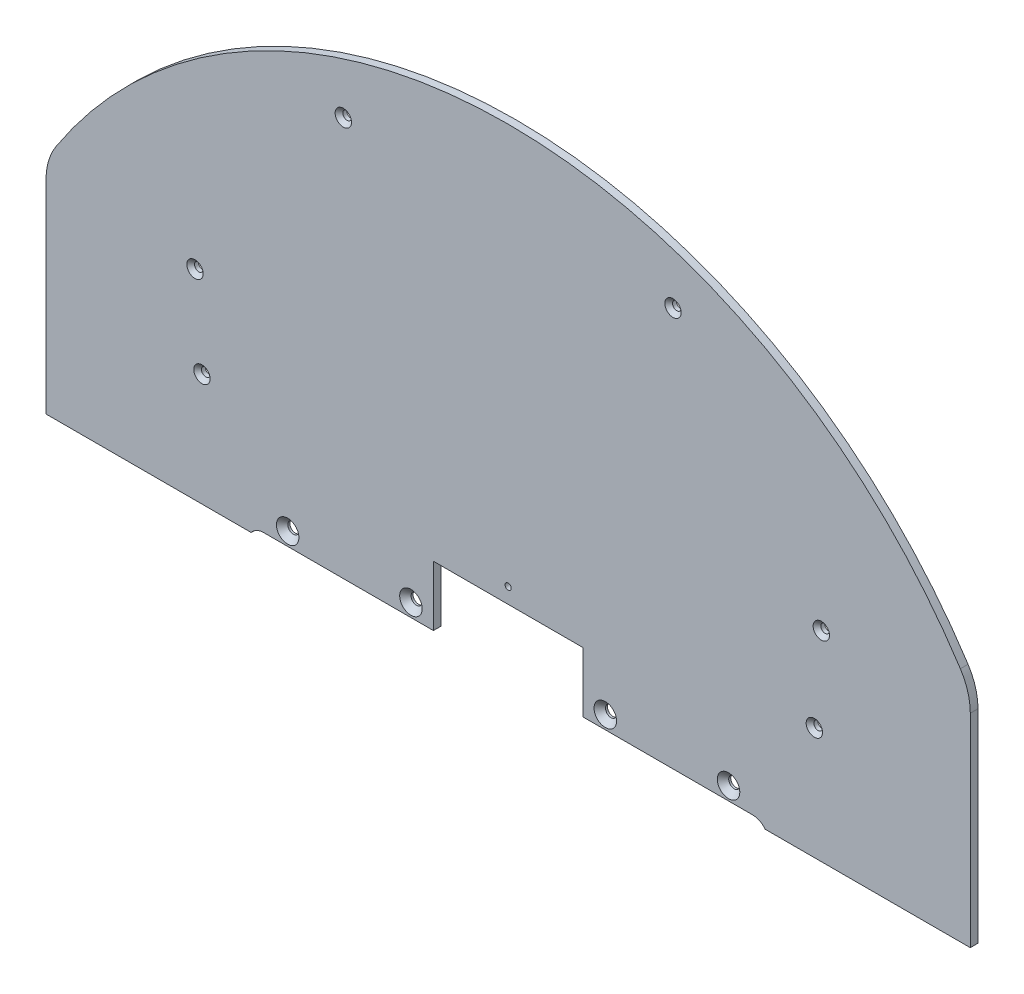
ISO-10303-21;
HEADER;
FILE_DESCRIPTION(('STEP AP214'),'2;1');
FILE_NAME('part.step','',(''),(''),'','','');
FILE_SCHEMA(('AUTOMOTIVE_DESIGN { 1 0 10303 214 1 1 1 1 }'));
ENDSEC;
DATA;
#1=APPLICATION_CONTEXT('core data for automotive mechanical design processes');
#2=APPLICATION_PROTOCOL_DEFINITION('international standard','automotive_design',2000,#1);
#3=PRODUCT_CONTEXT('',#1,'mechanical');
#4=PRODUCT('Part','Part','',(#3));
#5=PRODUCT_RELATED_PRODUCT_CATEGORY('part','',(#4));
#6=PRODUCT_DEFINITION_FORMATION('','',#4);
#7=PRODUCT_DEFINITION_CONTEXT('part definition',#1,'design');
#8=PRODUCT_DEFINITION('design','',#6,#7);
#9=PRODUCT_DEFINITION_SHAPE('','',#8);
#10=(LENGTH_UNIT() NAMED_UNIT(*) SI_UNIT(.MILLI.,.METRE.));
#11=(NAMED_UNIT(*) PLANE_ANGLE_UNIT() SI_UNIT($,.RADIAN.));
#12=(NAMED_UNIT(*) SI_UNIT($,.STERADIAN.) SOLID_ANGLE_UNIT());
#13=UNCERTAINTY_MEASURE_WITH_UNIT(LENGTH_MEASURE(1.E-05),#10,'distance_accuracy_value','');
#14=(GEOMETRIC_REPRESENTATION_CONTEXT(3) GLOBAL_UNCERTAINTY_ASSIGNED_CONTEXT((#13)) GLOBAL_UNIT_ASSIGNED_CONTEXT((#10,
#11,#12)) REPRESENTATION_CONTEXT('',''));
#15=CARTESIAN_POINT('',(0.,0.,0.));
#16=DIRECTION('',(0.,0.,1.));
#17=DIRECTION('',(1.,0.,0.));
#18=AXIS2_PLACEMENT_3D('',#15,#16,#17);
#19=CARTESIAN_POINT('',(-124.0409,61.2393999999982,145.6309));
#20=DIRECTION('',(0.,0.,-1.));
#21=DIRECTION('',(0.,-1.,0.));
#22=AXIS2_PLACEMENT_3D('',#19,#20,#21);
#23=CYLINDRICAL_SURFACE('',#22,1.778);
#24=CARTESIAN_POINT('',(-124.0409,61.2393999999982,144.0434));
#25=DIRECTION('',(0.,0.,-1.));
#26=DIRECTION('',(0.,-1.,0.));
#27=AXIS2_PLACEMENT_3D('',#24,#25,#26);
#28=CIRCLE('',#27,1.778);
#29=CARTESIAN_POINT('',(-124.0409,59.4613999999982,144.0434));
#30=VERTEX_POINT('',#29);
#31=EDGE_CURVE('E366',#30,#30,#28,.F.);
#32=ORIENTED_EDGE('',*,*,#31,.F.);
#33=EDGE_LOOP('',(#32));
#34=FACE_BOUND('',#33,.T.);
#35=CARTESIAN_POINT('',(-124.0409,61.2393999999982,145.6309));
#36=DIRECTION('',(0.,0.,1.));
#37=DIRECTION('',(0.,1.,0.));
#38=AXIS2_PLACEMENT_3D('',#35,#36,#37);
#39=CIRCLE('',#38,1.778);
#40=CARTESIAN_POINT('',(-124.0409,63.0173999999982,145.6309));
#41=VERTEX_POINT('',#40);
#42=EDGE_CURVE('E271',#41,#41,#39,.T.);
#43=ORIENTED_EDGE('',*,*,#42,.T.);
#44=EDGE_LOOP('',(#43));
#45=FACE_BOUND('',#44,.T.);
#46=ADVANCED_FACE('F36',(#34,#45),#23,.F.);
#47=CARTESIAN_POINT('',(134.1247,61.2393999999981,145.6309));
#48=DIRECTION('',(0.,0.,-1.));
#49=DIRECTION('',(0.,-1.,0.));
#50=AXIS2_PLACEMENT_3D('',#47,#48,#49);
#51=CYLINDRICAL_SURFACE('',#50,1.778);
#52=CARTESIAN_POINT('',(134.1247,61.2393999999981,144.0434));
#53=DIRECTION('',(0.,0.,-1.));
#54=DIRECTION('',(0.,-1.,0.));
#55=AXIS2_PLACEMENT_3D('',#52,#53,#54);
#56=CIRCLE('',#55,1.778);
#57=CARTESIAN_POINT('',(134.1247,59.4613999999981,144.0434));
#58=VERTEX_POINT('',#57);
#59=EDGE_CURVE('E363',#58,#58,#56,.F.);
#60=ORIENTED_EDGE('',*,*,#59,.F.);
#61=EDGE_LOOP('',(#60));
#62=FACE_BOUND('',#61,.T.);
#63=CARTESIAN_POINT('',(134.1247,61.2393999999981,145.6309));
#64=DIRECTION('',(0.,0.,1.));
#65=DIRECTION('',(0.,1.,0.));
#66=AXIS2_PLACEMENT_3D('',#63,#64,#65);
#67=CIRCLE('',#66,1.778);
#68=CARTESIAN_POINT('',(134.1247,63.0173999999981,145.6309));
#69=VERTEX_POINT('',#68);
#70=EDGE_CURVE('E274',#69,#69,#67,.T.);
#71=ORIENTED_EDGE('',*,*,#70,.T.);
#72=EDGE_LOOP('',(#71));
#73=FACE_BOUND('',#72,.T.);
#74=ADVANCED_FACE('F783',(#62,#73),#51,.F.);
#75=CARTESIAN_POINT('',(-62.9031000000003,145.859499999998,145.6309));
#76=DIRECTION('',(0.,0.,-1.));
#77=DIRECTION('',(0.,-1.,0.));
#78=AXIS2_PLACEMENT_3D('',#75,#76,#77);
#79=CYLINDRICAL_SURFACE('',#78,1.77800000000002);
#80=CARTESIAN_POINT('',(-62.9031000000003,145.859499999998,144.0434));
#81=DIRECTION('',(0.,0.,-1.));
#82=DIRECTION('',(0.,-1.,0.));
#83=AXIS2_PLACEMENT_3D('',#80,#81,#82);
#84=CIRCLE('',#83,1.77800000000002);
#85=CARTESIAN_POINT('',(-62.9031000000003,144.081499999998,144.0434));
#86=VERTEX_POINT('',#85);
#87=EDGE_CURVE('E360',#86,#86,#84,.F.);
#88=ORIENTED_EDGE('',*,*,#87,.F.);
#89=EDGE_LOOP('',(#88));
#90=FACE_BOUND('',#89,.T.);
#91=CARTESIAN_POINT('',(-62.9031000000003,145.859499999998,145.6309));
#92=DIRECTION('',(0.,0.,1.));
#93=DIRECTION('',(0.,1.,0.));
#94=AXIS2_PLACEMENT_3D('',#91,#92,#93);
#95=CIRCLE('',#94,1.77800000000002);
#96=CARTESIAN_POINT('',(-62.9031000000003,147.637499999998,145.6309));
#97=VERTEX_POINT('',#96);
#98=EDGE_CURVE('E277',#97,#97,#95,.T.);
#99=ORIENTED_EDGE('',*,*,#98,.T.);
#100=EDGE_LOOP('',(#99));
#101=FACE_BOUND('',#100,.T.);
#102=ADVANCED_FACE('F772',(#90,#101),#79,.F.);
#103=CARTESIAN_POINT('',(72.9868999999998,145.859499999998,145.6309));
#104=DIRECTION('',(0.,0.,-1.));
#105=DIRECTION('',(0.,-1.,0.));
#106=AXIS2_PLACEMENT_3D('',#103,#104,#105);
#107=CYLINDRICAL_SURFACE('',#106,1.778);
#108=CARTESIAN_POINT('',(72.9868999999998,145.859499999998,144.0434));
#109=DIRECTION('',(0.,0.,-1.));
#110=DIRECTION('',(0.,-1.,0.));
#111=AXIS2_PLACEMENT_3D('',#108,#109,#110);
#112=CIRCLE('',#111,1.778);
#113=CARTESIAN_POINT('',(72.9868999999998,144.081499999998,144.0434));
#114=VERTEX_POINT('',#113);
#115=EDGE_CURVE('E357',#114,#114,#112,.F.);
#116=ORIENTED_EDGE('',*,*,#115,.F.);
#117=EDGE_LOOP('',(#116));
#118=FACE_BOUND('',#117,.T.);
#119=CARTESIAN_POINT('',(72.9868999999998,145.859499999998,145.6309));
#120=DIRECTION('',(0.,0.,1.));
#121=DIRECTION('',(0.,1.,0.));
#122=AXIS2_PLACEMENT_3D('',#119,#120,#121);
#123=CIRCLE('',#122,1.778);
#124=CARTESIAN_POINT('',(72.9868999999998,147.637499999998,145.6309));
#125=VERTEX_POINT('',#124);
#126=EDGE_CURVE('E280',#125,#125,#123,.T.);
#127=ORIENTED_EDGE('',*,*,#126,.T.);
#128=EDGE_LOOP('',(#127));
#129=FACE_BOUND('',#128,.T.);
#130=ADVANCED_FACE('F761',(#118,#129),#107,.F.);
#131=CARTESIAN_POINT('',(-121.1707,25.1459999999989,145.6309));
#132=DIRECTION('',(0.,0.,-1.));
#133=DIRECTION('',(0.,-1.,0.));
#134=AXIS2_PLACEMENT_3D('',#131,#132,#133);
#135=CYLINDRICAL_SURFACE('',#134,1.77799999999999);
#136=CARTESIAN_POINT('',(-121.1707,25.1459999999989,144.0434));
#137=DIRECTION('',(0.,0.,-1.));
#138=DIRECTION('',(0.,-1.,0.));
#139=AXIS2_PLACEMENT_3D('',#136,#137,#138);
#140=CIRCLE('',#139,1.77799999999999);
#141=CARTESIAN_POINT('',(-121.1707,23.367999999999,144.0434));
#142=VERTEX_POINT('',#141);
#143=EDGE_CURVE('E354',#142,#142,#140,.F.);
#144=ORIENTED_EDGE('',*,*,#143,.F.);
#145=EDGE_LOOP('',(#144));
#146=FACE_BOUND('',#145,.T.);
#147=CARTESIAN_POINT('',(-121.1707,25.1459999999989,145.6309));
#148=DIRECTION('',(0.,0.,1.));
#149=DIRECTION('',(0.,1.,0.));
#150=AXIS2_PLACEMENT_3D('',#147,#148,#149);
#151=CIRCLE('',#150,1.77799999999999);
#152=CARTESIAN_POINT('',(-121.1707,26.9239999999989,145.6309));
#153=VERTEX_POINT('',#152);
#154=EDGE_CURVE('E283',#153,#153,#151,.T.);
#155=ORIENTED_EDGE('',*,*,#154,.T.);
#156=EDGE_LOOP('',(#155));
#157=FACE_BOUND('',#156,.T.);
#158=ADVANCED_FACE('F750',(#146,#157),#135,.F.);
#159=CARTESIAN_POINT('',(131.2545,25.1459999999989,145.6309));
#160=DIRECTION('',(0.,0.,-1.));
#161=DIRECTION('',(0.,-1.,0.));
#162=AXIS2_PLACEMENT_3D('',#159,#160,#161);
#163=CYLINDRICAL_SURFACE('',#162,1.778);
#164=CARTESIAN_POINT('',(131.2545,25.1459999999989,144.0434));
#165=DIRECTION('',(0.,0.,-1.));
#166=DIRECTION('',(0.,-1.,0.));
#167=AXIS2_PLACEMENT_3D('',#164,#165,#166);
#168=CIRCLE('',#167,1.778);
#169=CARTESIAN_POINT('',(131.2545,23.3679999999989,144.0434));
#170=VERTEX_POINT('',#169);
#171=EDGE_CURVE('E351',#170,#170,#168,.F.);
#172=ORIENTED_EDGE('',*,*,#171,.F.);
#173=EDGE_LOOP('',(#172));
#174=FACE_BOUND('',#173,.T.);
#175=CARTESIAN_POINT('',(131.2545,25.1459999999989,145.6309));
#176=DIRECTION('',(0.,0.,1.));
#177=DIRECTION('',(0.,1.,0.));
#178=AXIS2_PLACEMENT_3D('',#175,#176,#177);
#179=CIRCLE('',#178,1.778);
#180=CARTESIAN_POINT('',(131.2545,26.9239999999989,145.6309));
#181=VERTEX_POINT('',#180);
#182=EDGE_CURVE('E257',#181,#181,#179,.T.);
#183=ORIENTED_EDGE('',*,*,#182,.T.);
#184=EDGE_LOOP('',(#183));
#185=FACE_BOUND('',#184,.T.);
#186=ADVANCED_FACE('F739',(#174,#185),#163,.F.);
#187=CARTESIAN_POINT('',(-85.8393000000004,-13.2080000000011,144.8689));
#188=DIRECTION('',(0.,0.,-1.));
#189=DIRECTION('',(0.,-1.,0.));
#190=AXIS2_PLACEMENT_3D('',#187,#188,#189);
#191=CYLINDRICAL_SURFACE('',#190,2.28600000000002);
#192=CARTESIAN_POINT('',(-85.8393000000004,-13.2080000000011,144.0434));
#193=DIRECTION('',(0.,0.,-1.));
#194=DIRECTION('',(0.,-1.,0.));
#195=AXIS2_PLACEMENT_3D('',#192,#193,#194);
#196=CIRCLE('',#195,2.28600000000002);
#197=CARTESIAN_POINT('',(-85.8393000000004,-15.4940000000011,144.0434));
#198=VERTEX_POINT('',#197);
#199=EDGE_CURVE('E348',#198,#198,#196,.F.);
#200=ORIENTED_EDGE('',*,*,#199,.F.);
#201=EDGE_LOOP('',(#200));
#202=FACE_BOUND('',#201,.T.);
#203=CARTESIAN_POINT('',(-85.8393000000004,-13.208000000001,144.8689));
#204=DIRECTION('',(0.,0.,1.));
#205=DIRECTION('',(0.,1.,0.));
#206=AXIS2_PLACEMENT_3D('',#203,#204,#205);
#207=CIRCLE('',#206,2.28599999999999);
#208=CARTESIAN_POINT('',(-85.8393000000004,-10.922000000001,144.8689));
#209=VERTEX_POINT('',#208);
#210=EDGE_CURVE('E268',#209,#209,#207,.T.);
#211=ORIENTED_EDGE('',*,*,#210,.T.);
#212=EDGE_LOOP('',(#211));
#213=FACE_BOUND('',#212,.T.);
#214=ADVANCED_FACE('F728',(#202,#213),#191,.F.);
#215=CARTESIAN_POINT('',(-35.0393000000003,-13.208000000001,144.8689));
#216=DIRECTION('',(0.,0.,-1.));
#217=DIRECTION('',(0.,-1.,0.));
#218=AXIS2_PLACEMENT_3D('',#215,#216,#217);
#219=CYLINDRICAL_SURFACE('',#218,2.28600000000001);
#220=CARTESIAN_POINT('',(-35.0393000000003,-13.208000000001,144.0434));
#221=DIRECTION('',(0.,0.,-1.));
#222=DIRECTION('',(0.,-1.,0.));
#223=AXIS2_PLACEMENT_3D('',#220,#221,#222);
#224=CIRCLE('',#223,2.28600000000001);
#225=CARTESIAN_POINT('',(-35.0393000000003,-15.494000000001,144.0434));
#226=VERTEX_POINT('',#225);
#227=EDGE_CURVE('E345',#226,#226,#224,.F.);
#228=ORIENTED_EDGE('',*,*,#227,.F.);
#229=EDGE_LOOP('',(#228));
#230=FACE_BOUND('',#229,.T.);
#231=CARTESIAN_POINT('',(-35.0393000000003,-13.208000000001,144.8689));
#232=DIRECTION('',(0.,0.,1.));
#233=DIRECTION('',(0.,1.,0.));
#234=AXIS2_PLACEMENT_3D('',#231,#232,#233);
#235=CIRCLE('',#234,2.28600000000001);
#236=CARTESIAN_POINT('',(-35.0393000000003,-10.922000000001,144.8689));
#237=VERTEX_POINT('',#236);
#238=EDGE_CURVE('E265',#237,#237,#235,.T.);
#239=ORIENTED_EDGE('',*,*,#238,.T.);
#240=EDGE_LOOP('',(#239));
#241=FACE_BOUND('',#240,.T.);
#242=ADVANCED_FACE('F717',(#230,#241),#219,.F.);
#243=CARTESIAN_POINT('',(45.0976999999997,-13.2080000000011,144.8689));
#244=DIRECTION('',(0.,0.,-1.));
#245=DIRECTION('',(0.,-1.,0.));
#246=AXIS2_PLACEMENT_3D('',#243,#244,#245);
#247=CYLINDRICAL_SURFACE('',#246,2.286);
#248=CARTESIAN_POINT('',(45.0976999999997,-13.2080000000011,144.0434));
#249=DIRECTION('',(0.,0.,-1.));
#250=DIRECTION('',(0.,-1.,0.));
#251=AXIS2_PLACEMENT_3D('',#248,#249,#250);
#252=CIRCLE('',#251,2.286);
#253=CARTESIAN_POINT('',(45.0976999999997,-15.4940000000011,144.0434));
#254=VERTEX_POINT('',#253);
#255=EDGE_CURVE('E342',#254,#254,#252,.F.);
#256=ORIENTED_EDGE('',*,*,#255,.F.);
#257=EDGE_LOOP('',(#256));
#258=FACE_BOUND('',#257,.T.);
#259=CARTESIAN_POINT('',(45.0976999999997,-13.2080000000013,144.8689));
#260=DIRECTION('',(0.,0.,1.));
#261=DIRECTION('',(0.,1.,0.));
#262=AXIS2_PLACEMENT_3D('',#259,#260,#261);
#263=CIRCLE('',#262,2.28600000000012);
#264=CARTESIAN_POINT('',(45.0976999999997,-10.9220000000012,144.8689));
#265=VERTEX_POINT('',#264);
#266=EDGE_CURVE('E262',#265,#265,#263,.T.);
#267=ORIENTED_EDGE('',*,*,#266,.T.);
#268=EDGE_LOOP('',(#267));
#269=FACE_BOUND('',#268,.T.);
#270=ADVANCED_FACE('F706',(#258,#269),#247,.F.);
#271=CARTESIAN_POINT('',(95.8976999999997,-13.2080000000011,144.8689));
#272=DIRECTION('',(0.,0.,-1.));
#273=DIRECTION('',(0.,-1.,0.));
#274=AXIS2_PLACEMENT_3D('',#271,#272,#273);
#275=CYLINDRICAL_SURFACE('',#274,2.28600000000001);
#276=CARTESIAN_POINT('',(95.8976999999997,-13.2080000000011,144.0434));
#277=DIRECTION('',(0.,0.,-1.));
#278=DIRECTION('',(0.,-1.,0.));
#279=AXIS2_PLACEMENT_3D('',#276,#277,#278);
#280=CIRCLE('',#279,2.28600000000001);
#281=CARTESIAN_POINT('',(95.8976999999997,-15.4940000000011,144.0434));
#282=VERTEX_POINT('',#281);
#283=EDGE_CURVE('E339',#282,#282,#280,.F.);
#284=ORIENTED_EDGE('',*,*,#283,.F.);
#285=EDGE_LOOP('',(#284));
#286=FACE_BOUND('',#285,.T.);
#287=CARTESIAN_POINT('',(95.8976999999997,-13.2080000000014,144.8689));
#288=DIRECTION('',(0.,0.,1.));
#289=DIRECTION('',(0.,1.,0.));
#290=AXIS2_PLACEMENT_3D('',#287,#288,#289);
#291=CIRCLE('',#290,2.28600000000014);
#292=CARTESIAN_POINT('',(95.8976999999997,-10.9220000000012,144.8689));
#293=VERTEX_POINT('',#292);
#294=EDGE_CURVE('E215',#293,#293,#291,.T.);
#295=ORIENTED_EDGE('',*,*,#294,.T.);
#296=EDGE_LOOP('',(#295));
#297=FACE_BOUND('',#296,.T.);
#298=ADVANCED_FACE('F696',(#286,#297),#275,.F.);
#299=CARTESIAN_POINT('',(105.8799,-18.6690000000011,144.0434));
#300=DIRECTION('',(0.,-1.,0.));
#301=DIRECTION('',(0.,0.,1.));
#302=AXIS2_PLACEMENT_3D('',#299,#300,#301);
#303=PLANE('',#302);
#304=DIRECTION('',(0.,0.,1.));
#305=VECTOR('',#304,1.);
#306=CARTESIAN_POINT('',(35.8266999999997,-18.669000000001,145.6309));
#307=LINE('',#306,#305);
#308=CARTESIAN_POINT('',(35.8266999999992,-18.6690000000012,144.0434));
#309=VERTEX_POINT('',#308);
#310=CARTESIAN_POINT('',(35.8266999999992,-18.6690000000012,147.2184));
#311=VERTEX_POINT('',#310);
#312=EDGE_CURVE('E228',#309,#311,#307,.T.);
#313=ORIENTED_EDGE('',*,*,#312,.F.);
#314=DIRECTION('',(-1.,0.,0.));
#315=VECTOR('',#314,1.);
#316=CARTESIAN_POINT('',(5.04189999999904,-18.6690000000013,144.0434));
#317=LINE('',#316,#315);
#318=CARTESIAN_POINT('',(105.8799,-18.6690000000012,144.0434));
#319=VERTEX_POINT('',#318);
#320=EDGE_CURVE('E188',#319,#309,#317,.T.);
#321=ORIENTED_EDGE('',*,*,#320,.F.);
#322=DIRECTION('',(0.,0.,-1.));
#323=VECTOR('',#322,1.);
#324=CARTESIAN_POINT('',(105.8799,-18.669000000001,145.6309));
#325=LINE('',#324,#323);
#326=CARTESIAN_POINT('',(105.8799,-18.6690000000011,147.2184));
#327=VERTEX_POINT('',#326);
#328=EDGE_CURVE('E225',#327,#319,#325,.T.);
#329=ORIENTED_EDGE('',*,*,#328,.F.);
#330=DIRECTION('',(1.,0.,0.));
#331=VECTOR('',#330,1.);
#332=CARTESIAN_POINT('',(5.04189999999903,-18.6690000000012,147.2184));
#333=LINE('',#332,#331);
#334=EDGE_CURVE('E213',#311,#327,#333,.T.);
#335=ORIENTED_EDGE('',*,*,#334,.F.);
#336=EDGE_LOOP('',(#313,#321,#329,#335));
#337=FACE_BOUND('',#336,.T.);
#338=ADVANCED_FACE('F403',(#337),#303,.T.);
#339=CARTESIAN_POINT('',(105.8799,-25.0190000000013,147.2184));
#340=DIRECTION('',(0.,0.,-1.));
#341=DIRECTION('',(0.,-1.,0.));
#342=AXIS2_PLACEMENT_3D('',#339,#340,#341);
#343=CYLINDRICAL_SURFACE('',#342,6.35000000000011);
#344=CARTESIAN_POINT('',(105.8799,-25.0190000000013,147.2184));
#345=DIRECTION('',(0.,0.,-1.));
#346=DIRECTION('',(0.,-1.,0.));
#347=AXIS2_PLACEMENT_3D('',#344,#345,#346);
#348=CIRCLE('',#347,6.35000000000011);
#349=CARTESIAN_POINT('',(110.9599,-21.2090000000012,147.2184));
#350=VERTEX_POINT('',#349);
#351=EDGE_CURVE('E334',#327,#350,#348,.T.);
#352=ORIENTED_EDGE('',*,*,#351,.F.);
#353=ORIENTED_EDGE('',*,*,#328,.T.);
#354=CARTESIAN_POINT('',(105.8799,-25.0190000000013,144.0434));
#355=DIRECTION('',(0.,0.,-1.));
#356=DIRECTION('',(0.,-1.,0.));
#357=AXIS2_PLACEMENT_3D('',#354,#355,#356);
#358=CIRCLE('',#357,6.35000000000011);
#359=CARTESIAN_POINT('',(110.9599,-21.2090000000012,144.0434));
#360=VERTEX_POINT('',#359);
#361=EDGE_CURVE('E174',#360,#319,#358,.F.);
#362=ORIENTED_EDGE('',*,*,#361,.F.);
#363=DIRECTION('',(0.,0.,-1.));
#364=VECTOR('',#363,1.);
#365=CARTESIAN_POINT('',(110.9599,-21.2090000000011,145.6309));
#366=LINE('',#365,#364);
#367=EDGE_CURVE('E221',#350,#360,#366,.T.);
#368=ORIENTED_EDGE('',*,*,#367,.F.);
#369=EDGE_LOOP('',(#352,#353,#362,#368));
#370=FACE_BOUND('',#369,.T.);
#371=ADVANCED_FACE('F400',(#370),#343,.F.);
#372=CARTESIAN_POINT('',(195.541899999999,-21.2090000000011,144.0434));
#373=DIRECTION('',(0.,-1.,0.));
#374=DIRECTION('',(0.,0.,1.));
#375=AXIS2_PLACEMENT_3D('',#372,#373,#374);
#376=PLANE('',#375);
#377=DIRECTION('',(1.,0.,0.));
#378=VECTOR('',#377,1.);
#379=CARTESIAN_POINT('',(5.04189999999904,-21.2090000000013,147.2184));
#380=LINE('',#379,#378);
#381=CARTESIAN_POINT('',(195.541899999999,-21.2090000000013,147.2184));
#382=VERTEX_POINT('',#381);
#383=EDGE_CURVE('E337',#350,#382,#380,.T.);
#384=ORIENTED_EDGE('',*,*,#383,.F.);
#385=ORIENTED_EDGE('',*,*,#367,.T.);
#386=DIRECTION('',(-1.,0.,0.));
#387=VECTOR('',#386,1.);
#388=CARTESIAN_POINT('',(5.04189999999904,-21.2090000000013,144.0434));
#389=LINE('',#388,#387);
#390=CARTESIAN_POINT('',(195.541899999999,-21.2090000000013,144.0434));
#391=VERTEX_POINT('',#390);
#392=EDGE_CURVE('E172',#391,#360,#389,.T.);
#393=ORIENTED_EDGE('',*,*,#392,.F.);
#394=DIRECTION('',(0.,0.,-1.));
#395=VECTOR('',#394,1.);
#396=CARTESIAN_POINT('',(195.541899999999,-21.2090000000011,145.6309));
#397=LINE('',#396,#395);
#398=EDGE_CURVE('E219',#382,#391,#397,.T.);
#399=ORIENTED_EDGE('',*,*,#398,.F.);
#400=EDGE_LOOP('',(#384,#385,#393,#399));
#401=FACE_BOUND('',#400,.T.);
#402=ADVANCED_FACE('F396',(#401),#376,.T.);
#403=CARTESIAN_POINT('',(195.541899999999,-21.2090000000011,147.2184));
#404=DIRECTION('',(1.,0.,0.));
#405=DIRECTION('',(0.,0.,-1.));
#406=AXIS2_PLACEMENT_3D('',#403,#404,#405);
#407=PLANE('',#406);
#408=DIRECTION('',(0.,1.,0.));
#409=VECTOR('',#408,1.);
#410=CARTESIAN_POINT('',(195.541899999999,79.3164937845302,147.2184));
#411=LINE('',#410,#409);
#412=CARTESIAN_POINT('',(195.541899999999,62.4963381524513,147.2184));
#413=VERTEX_POINT('',#412);
#414=EDGE_CURVE('E333',#382,#413,#411,.T.);
#415=ORIENTED_EDGE('',*,*,#414,.F.);
#416=ORIENTED_EDGE('',*,*,#398,.T.);
#417=DIRECTION('',(0.,-1.,0.));
#418=VECTOR('',#417,1.);
#419=CARTESIAN_POINT('',(195.541899999999,79.3164937845306,144.0434));
#420=LINE('',#419,#418);
#421=CARTESIAN_POINT('',(195.541899999999,62.4963381524513,144.0434));
#422=VERTEX_POINT('',#421);
#423=EDGE_CURVE('E175',#422,#391,#420,.T.);
#424=ORIENTED_EDGE('',*,*,#423,.F.);
#425=DIRECTION('',(0.,0.,-1.));
#426=VECTOR('',#425,1.);
#427=CARTESIAN_POINT('',(195.541899999999,62.4963381524515,145.6309));
#428=LINE('',#427,#426);
#429=EDGE_CURVE('E217',#413,#422,#428,.T.);
#430=ORIENTED_EDGE('',*,*,#429,.F.);
#431=EDGE_LOOP('',(#415,#416,#424,#430));
#432=FACE_BOUND('',#431,.T.);
#433=ADVANCED_FACE('F391',(#432),#407,.T.);
#434=CARTESIAN_POINT('',(170.141900000001,62.4963381524512,147.2184));
#435=DIRECTION('',(0.,0.,-1.));
#436=DIRECTION('',(0.,-1.,0.));
#437=AXIS2_PLACEMENT_3D('',#434,#435,#436);
#438=CYLINDRICAL_SURFACE('',#437,25.4000000000009);
#439=CARTESIAN_POINT('',(170.141900000001,62.4963381524512,144.0434));
#440=DIRECTION('',(0.,0.,-1.));
#441=DIRECTION('',(0.,-1.,0.));
#442=AXIS2_PLACEMENT_3D('',#439,#440,#441);
#443=CIRCLE('',#442,25.4000000000009);
#444=CARTESIAN_POINT('',(191.445125806452,76.3286398495414,144.0434));
#445=VERTEX_POINT('',#444);
#446=EDGE_CURVE('E180',#445,#422,#443,.T.);
#447=ORIENTED_EDGE('',*,*,#446,.F.);
#448=DIRECTION('',(0.,0.,-1.));
#449=VECTOR('',#448,1.);
#450=CARTESIAN_POINT('',(191.445125806451,76.3286398495404,145.6309));
#451=LINE('',#450,#449);
#452=CARTESIAN_POINT('',(191.445125806451,76.3286398495402,147.2184));
#453=VERTEX_POINT('',#452);
#454=EDGE_CURVE('E208',#453,#445,#451,.T.);
#455=ORIENTED_EDGE('',*,*,#454,.F.);
#456=CARTESIAN_POINT('',(170.141900000001,62.4963381524512,147.2184));
#457=DIRECTION('',(0.,0.,-1.));
#458=DIRECTION('',(0.,-1.,0.));
#459=AXIS2_PLACEMENT_3D('',#456,#457,#458);
#460=CIRCLE('',#459,25.4000000000009);
#461=EDGE_CURVE('E330',#413,#453,#460,.F.);
#462=ORIENTED_EDGE('',*,*,#461,.F.);
#463=ORIENTED_EDGE('',*,*,#429,.T.);
#464=EDGE_LOOP('',(#447,#455,#462,#463));
#465=FACE_BOUND('',#464,.T.);
#466=ADVANCED_FACE('F386',(#465),#438,.T.);
#467=CARTESIAN_POINT('',(5.04189999999968,-44.7040000000026,147.2184));
#468=DIRECTION('',(0.,0.,-1.));
#469=DIRECTION('',(0.,-1.,0.));
#470=AXIS2_PLACEMENT_3D('',#467,#468,#469);
#471=CYLINDRICAL_SURFACE('',#470,222.249999999999);
#472=DIRECTION('',(0.,0.,-1.));
#473=VECTOR('',#472,1.);
#474=CARTESIAN_POINT('',(-181.361325806452,76.3286398495408,145.6309));
#475=LINE('',#474,#473);
#476=CARTESIAN_POINT('',(-181.361325806454,76.3286398495418,147.2184));
#477=VERTEX_POINT('',#476);
#478=CARTESIAN_POINT('',(-181.361325806451,76.3286398495403,144.0434));
#479=VERTEX_POINT('',#478);
#480=EDGE_CURVE('E192',#477,#479,#475,.T.);
#481=ORIENTED_EDGE('',*,*,#480,.F.);
#482=CARTESIAN_POINT('',(5.04189999999968,-44.7040000000026,147.2184));
#483=DIRECTION('',(0.,0.,-1.));
#484=DIRECTION('',(0.,-1.,0.));
#485=AXIS2_PLACEMENT_3D('',#482,#483,#484);
#486=CIRCLE('',#485,222.249999999999);
#487=EDGE_CURVE('E327',#453,#477,#486,.F.);
#488=ORIENTED_EDGE('',*,*,#487,.F.);
#489=ORIENTED_EDGE('',*,*,#454,.T.);
#490=CARTESIAN_POINT('',(5.04189999999968,-44.7040000000026,144.0434));
#491=DIRECTION('',(0.,0.,-1.));
#492=DIRECTION('',(0.,-1.,0.));
#493=AXIS2_PLACEMENT_3D('',#490,#491,#492);
#494=CIRCLE('',#493,222.249999999999);
#495=EDGE_CURVE('E375',#479,#445,#494,.T.);
#496=ORIENTED_EDGE('',*,*,#495,.F.);
#497=EDGE_LOOP('',(#481,#488,#489,#496));
#498=FACE_BOUND('',#497,.T.);
#499=ADVANCED_FACE('F382',(#498),#471,.T.);
#500=CARTESIAN_POINT('',(-25.7683000000003,-18.669000000001,144.0434));
#501=DIRECTION('',(0.,-1.,0.));
#502=DIRECTION('',(0.,0.,1.));
#503=AXIS2_PLACEMENT_3D('',#500,#501,#502);
#504=PLANE('',#503);
#505=DIRECTION('',(0.,0.,-1.));
#506=VECTOR('',#505,1.);
#507=CARTESIAN_POINT('',(-25.7683000000003,-18.669000000001,145.6309));
#508=LINE('',#507,#506);
#509=CARTESIAN_POINT('',(-25.7683000000008,-18.6690000000012,147.2184));
#510=VERTEX_POINT('',#509);
#511=CARTESIAN_POINT('',(-25.7683000000008,-18.6690000000012,144.0434));
#512=VERTEX_POINT('',#511);
#513=EDGE_CURVE('E205',#510,#512,#508,.T.);
#514=ORIENTED_EDGE('',*,*,#513,.F.);
#515=DIRECTION('',(1.,0.,0.));
#516=VECTOR('',#515,1.);
#517=CARTESIAN_POINT('',(5.04189999999904,-18.6690000000012,147.2184));
#518=LINE('',#517,#516);
#519=CARTESIAN_POINT('',(-95.7961000000004,-18.6690000000011,147.2184));
#520=VERTEX_POINT('',#519);
#521=EDGE_CURVE('E202',#520,#510,#518,.T.);
#522=ORIENTED_EDGE('',*,*,#521,.F.);
#523=DIRECTION('',(0.,0.,1.));
#524=VECTOR('',#523,1.);
#525=CARTESIAN_POINT('',(-95.7961000000005,-18.669000000001,145.6309));
#526=LINE('',#525,#524);
#527=CARTESIAN_POINT('',(-95.7961000000004,-18.6690000000011,144.0434));
#528=VERTEX_POINT('',#527);
#529=EDGE_CURVE('E211',#528,#520,#526,.T.);
#530=ORIENTED_EDGE('',*,*,#529,.F.);
#531=DIRECTION('',(-1.,0.,0.));
#532=VECTOR('',#531,1.);
#533=CARTESIAN_POINT('',(5.04189999999904,-18.6690000000013,144.0434));
#534=LINE('',#533,#532);
#535=EDGE_CURVE('E183',#512,#528,#534,.T.);
#536=ORIENTED_EDGE('',*,*,#535,.F.);
#537=EDGE_LOOP('',(#514,#522,#530,#536));
#538=FACE_BOUND('',#537,.T.);
#539=ADVANCED_FACE('F421',(#538),#504,.T.);
#540=CARTESIAN_POINT('',(-25.7683000000003,-18.669000000001,147.2184));
#541=DIRECTION('',(1.,0.,0.));
#542=DIRECTION('',(0.,0.,-1.));
#543=AXIS2_PLACEMENT_3D('',#540,#541,#542);
#544=PLANE('',#543);
#545=DIRECTION('',(0.,0.,-1.));
#546=VECTOR('',#545,1.);
#547=CARTESIAN_POINT('',(-25.7683000000003,6.09599999999896,145.6309));
#548=LINE('',#547,#546);
#549=CARTESIAN_POINT('',(-25.7683000000006,6.09599999999882,147.2184));
#550=VERTEX_POINT('',#549);
#551=CARTESIAN_POINT('',(-25.7683000000008,6.09599999999877,144.0434));
#552=VERTEX_POINT('',#551);
#553=EDGE_CURVE('E207',#550,#552,#548,.T.);
#554=ORIENTED_EDGE('',*,*,#553,.F.);
#555=DIRECTION('',(0.,1.,0.));
#556=VECTOR('',#555,1.);
#557=CARTESIAN_POINT('',(-25.768300000001,79.3164937845304,147.2184));
#558=LINE('',#557,#556);
#559=EDGE_CURVE('E198',#510,#550,#558,.T.);
#560=ORIENTED_EDGE('',*,*,#559,.F.);
#561=ORIENTED_EDGE('',*,*,#513,.T.);
#562=DIRECTION('',(0.,-1.,0.));
#563=VECTOR('',#562,1.);
#564=CARTESIAN_POINT('',(-25.768300000001,79.3164937845307,144.0434));
#565=LINE('',#564,#563);
#566=EDGE_CURVE('E185',#552,#512,#565,.T.);
#567=ORIENTED_EDGE('',*,*,#566,.F.);
#568=EDGE_LOOP('',(#554,#560,#561,#567));
#569=FACE_BOUND('',#568,.T.);
#570=ADVANCED_FACE('F416',(#569),#544,.T.);
#571=CARTESIAN_POINT('',(35.8266999999997,6.09599999999896,144.0434));
#572=DIRECTION('',(0.,-1.,0.));
#573=DIRECTION('',(0.,0.,1.));
#574=AXIS2_PLACEMENT_3D('',#571,#572,#573);
#575=PLANE('',#574);
#576=DIRECTION('',(-1.,0.,0.));
#577=VECTOR('',#576,1.);
#578=CARTESIAN_POINT('',(5.04189999999904,6.09599999999866,144.0434));
#579=LINE('',#578,#577);
#580=CARTESIAN_POINT('',(35.8266999999992,6.09599999999877,144.0434));
#581=VERTEX_POINT('',#580);
#582=EDGE_CURVE('E242',#581,#552,#579,.T.);
#583=ORIENTED_EDGE('',*,*,#582,.F.);
#584=DIRECTION('',(0.,0.,-1.));
#585=VECTOR('',#584,1.);
#586=CARTESIAN_POINT('',(35.8266999999997,6.09599999999896,145.6309));
#587=LINE('',#586,#585);
#588=CARTESIAN_POINT('',(35.8266999999993,6.09599999999894,147.2184));
#589=VERTEX_POINT('',#588);
#590=EDGE_CURVE('E231',#589,#581,#587,.T.);
#591=ORIENTED_EDGE('',*,*,#590,.F.);
#592=DIRECTION('',(1.,0.,0.));
#593=VECTOR('',#592,1.);
#594=CARTESIAN_POINT('',(5.04189999999906,6.09599999999869,147.2184));
#595=LINE('',#594,#593);
#596=EDGE_CURVE('E201',#550,#589,#595,.T.);
#597=ORIENTED_EDGE('',*,*,#596,.F.);
#598=ORIENTED_EDGE('',*,*,#553,.T.);
#599=EDGE_LOOP('',(#583,#591,#597,#598));
#600=FACE_BOUND('',#599,.T.);
#601=ADVANCED_FACE('F411',(#600),#575,.T.);
#602=CARTESIAN_POINT('',(35.8266999999997,-18.669000000001,144.0434));
#603=DIRECTION('',(-1.,0.,0.));
#604=DIRECTION('',(0.,0.,1.));
#605=AXIS2_PLACEMENT_3D('',#602,#603,#604);
#606=PLANE('',#605);
#607=ORIENTED_EDGE('',*,*,#590,.T.);
#608=DIRECTION('',(0.,1.,0.));
#609=VECTOR('',#608,1.);
#610=CARTESIAN_POINT('',(35.826699999999,79.3164937845306,144.0434));
#611=LINE('',#610,#609);
#612=EDGE_CURVE('E191',#309,#581,#611,.T.);
#613=ORIENTED_EDGE('',*,*,#612,.F.);
#614=ORIENTED_EDGE('',*,*,#312,.T.);
#615=DIRECTION('',(0.,-1.,0.));
#616=VECTOR('',#615,1.);
#617=CARTESIAN_POINT('',(35.826699999999,79.3164937845303,147.2184));
#618=LINE('',#617,#616);
#619=EDGE_CURVE('E234',#589,#311,#618,.T.);
#620=ORIENTED_EDGE('',*,*,#619,.F.);
#621=EDGE_LOOP('',(#607,#613,#614,#620));
#622=FACE_BOUND('',#621,.T.);
#623=ADVANCED_FACE('F407',(#622),#606,.T.);
#624=CARTESIAN_POINT('',(131.2545,25.1459999999989,147.2184));
#625=DIRECTION('',(0.,0.,1.));
#626=DIRECTION('',(0.,1.,0.));
#627=AXIS2_PLACEMENT_3D('',#624,#625,#626);
#628=CONICAL_SURFACE('',#627,3.36550000000008,0.78539816339748);
#629=ORIENTED_EDGE('',*,*,#182,.F.);
#630=EDGE_LOOP('',(#629));
#631=FACE_BOUND('',#630,.T.);
#632=CARTESIAN_POINT('',(131.2545,25.1459999999989,147.2184));
#633=DIRECTION('',(0.,0.,1.));
#634=DIRECTION('',(0.,1.,0.));
#635=AXIS2_PLACEMENT_3D('',#632,#633,#634);
#636=CIRCLE('',#635,3.3655000000001);
#637=CARTESIAN_POINT('',(131.2545,28.511499999999,147.2184));
#638=VERTEX_POINT('',#637);
#639=EDGE_CURVE('E237',#638,#638,#636,.F.);
#640=ORIENTED_EDGE('',*,*,#639,.F.);
#641=EDGE_LOOP('',(#640));
#642=FACE_BOUND('',#641,.T.);
#643=ADVANCED_FACE('F594',(#631,#642),#628,.F.);
#644=CARTESIAN_POINT('',(-121.1707,25.1459999999989,147.2184));
#645=DIRECTION('',(0.,0.,1.));
#646=DIRECTION('',(0.,1.,0.));
#647=AXIS2_PLACEMENT_3D('',#644,#645,#646);
#648=CONICAL_SURFACE('',#647,3.36550000000008,0.78539816339748);
#649=ORIENTED_EDGE('',*,*,#154,.F.);
#650=EDGE_LOOP('',(#649));
#651=FACE_BOUND('',#650,.T.);
#652=CARTESIAN_POINT('',(-121.1707,25.1459999999989,147.2184));
#653=DIRECTION('',(0.,0.,1.));
#654=DIRECTION('',(0.,1.,0.));
#655=AXIS2_PLACEMENT_3D('',#652,#653,#654);
#656=CIRCLE('',#655,3.3655000000001);
#657=CARTESIAN_POINT('',(-121.1707,28.5114999999991,147.2184));
#658=VERTEX_POINT('',#657);
#659=EDGE_CURVE('E318',#658,#658,#656,.F.);
#660=ORIENTED_EDGE('',*,*,#659,.F.);
#661=EDGE_LOOP('',(#660));
#662=FACE_BOUND('',#661,.T.);
#663=ADVANCED_FACE('F583',(#651,#662),#648,.F.);
#664=CARTESIAN_POINT('',(72.9868999999998,145.859499999998,147.2184));
#665=DIRECTION('',(0.,0.,1.));
#666=DIRECTION('',(0.,1.,0.));
#667=AXIS2_PLACEMENT_3D('',#664,#665,#666);
#668=CONICAL_SURFACE('',#667,3.36549999999997,0.785398163397437);
#669=ORIENTED_EDGE('',*,*,#126,.F.);
#670=EDGE_LOOP('',(#669));
#671=FACE_BOUND('',#670,.T.);
#672=CARTESIAN_POINT('',(72.9868999999998,145.859499999998,147.2184));
#673=DIRECTION('',(0.,0.,1.));
#674=DIRECTION('',(0.,1.,0.));
#675=AXIS2_PLACEMENT_3D('',#672,#673,#674);
#676=CIRCLE('',#675,3.36549999999991);
#677=CARTESIAN_POINT('',(72.9868999999998,149.224999999998,147.2184));
#678=VERTEX_POINT('',#677);
#679=EDGE_CURVE('E315',#678,#678,#676,.F.);
#680=ORIENTED_EDGE('',*,*,#679,.F.);
#681=EDGE_LOOP('',(#680));
#682=FACE_BOUND('',#681,.T.);
#683=ADVANCED_FACE('F572',(#671,#682),#668,.F.);
#684=CARTESIAN_POINT('',(-62.9031000000003,145.859499999998,147.2184));
#685=DIRECTION('',(0.,0.,1.));
#686=DIRECTION('',(0.,1.,0.));
#687=AXIS2_PLACEMENT_3D('',#684,#685,#686);
#688=CONICAL_SURFACE('',#687,3.36549999999997,0.785398163397437);
#689=ORIENTED_EDGE('',*,*,#98,.F.);
#690=EDGE_LOOP('',(#689));
#691=FACE_BOUND('',#690,.T.);
#692=CARTESIAN_POINT('',(-62.9031000000003,145.859499999998,147.2184));
#693=DIRECTION('',(0.,0.,1.));
#694=DIRECTION('',(0.,1.,0.));
#695=AXIS2_PLACEMENT_3D('',#692,#693,#694);
#696=CIRCLE('',#695,3.36549999999991);
#697=CARTESIAN_POINT('',(-62.9031000000003,149.224999999998,147.2184));
#698=VERTEX_POINT('',#697);
#699=EDGE_CURVE('E312',#698,#698,#696,.F.);
#700=ORIENTED_EDGE('',*,*,#699,.F.);
#701=EDGE_LOOP('',(#700));
#702=FACE_BOUND('',#701,.T.);
#703=ADVANCED_FACE('F561',(#691,#702),#688,.F.);
#704=CARTESIAN_POINT('',(134.1247,61.2393999999981,147.2184));
#705=DIRECTION('',(0.,0.,1.));
#706=DIRECTION('',(0.,1.,0.));
#707=AXIS2_PLACEMENT_3D('',#704,#705,#706);
#708=CONICAL_SURFACE('',#707,3.36549999999997,0.785398163397437);
#709=ORIENTED_EDGE('',*,*,#70,.F.);
#710=EDGE_LOOP('',(#709));
#711=FACE_BOUND('',#710,.T.);
#712=CARTESIAN_POINT('',(134.1247,61.2393999999981,147.2184));
#713=DIRECTION('',(0.,0.,1.));
#714=DIRECTION('',(0.,1.,0.));
#715=AXIS2_PLACEMENT_3D('',#712,#713,#714);
#716=CIRCLE('',#715,3.3654999999998);
#717=CARTESIAN_POINT('',(134.1247,64.6048999999979,147.2184));
#718=VERTEX_POINT('',#717);
#719=EDGE_CURVE('E309',#718,#718,#716,.F.);
#720=ORIENTED_EDGE('',*,*,#719,.F.);
#721=EDGE_LOOP('',(#720));
#722=FACE_BOUND('',#721,.T.);
#723=ADVANCED_FACE('F550',(#711,#722),#708,.F.);
#724=CARTESIAN_POINT('',(-124.0409,61.2393999999982,147.2184));
#725=DIRECTION('',(0.,0.,1.));
#726=DIRECTION('',(0.,1.,0.));
#727=AXIS2_PLACEMENT_3D('',#724,#725,#726);
#728=CONICAL_SURFACE('',#727,3.36549999999997,0.785398163397437);
#729=ORIENTED_EDGE('',*,*,#42,.F.);
#730=EDGE_LOOP('',(#729));
#731=FACE_BOUND('',#730,.T.);
#732=CARTESIAN_POINT('',(-124.0409,61.2393999999982,147.2184));
#733=DIRECTION('',(0.,0.,1.));
#734=DIRECTION('',(0.,1.,0.));
#735=AXIS2_PLACEMENT_3D('',#732,#733,#734);
#736=CIRCLE('',#735,3.3654999999998);
#737=CARTESIAN_POINT('',(-124.0409,64.604899999998,147.2184));
#738=VERTEX_POINT('',#737);
#739=EDGE_CURVE('E306',#738,#738,#736,.F.);
#740=ORIENTED_EDGE('',*,*,#739,.F.);
#741=EDGE_LOOP('',(#740));
#742=FACE_BOUND('',#741,.T.);
#743=ADVANCED_FACE('F539',(#731,#742),#728,.F.);
#744=CARTESIAN_POINT('',(5.0418999999997,12.4459999999989,147.2184));
#745=DIRECTION('',(0.,0.,-1.));
#746=DIRECTION('',(0.,-1.,0.));
#747=AXIS2_PLACEMENT_3D('',#744,#745,#746);
#748=CYLINDRICAL_SURFACE('',#747,1.26999999999999);
#749=CARTESIAN_POINT('',(5.0418999999997,12.4459999999989,144.0434));
#750=DIRECTION('',(0.,0.,-1.));
#751=DIRECTION('',(0.,-1.,0.));
#752=AXIS2_PLACEMENT_3D('',#749,#750,#751);
#753=CIRCLE('',#752,1.26999999999999);
#754=CARTESIAN_POINT('',(5.0418999999997,11.1759999999989,144.0434));
#755=VERTEX_POINT('',#754);
#756=EDGE_CURVE('E369',#755,#755,#753,.F.);
#757=ORIENTED_EDGE('',*,*,#756,.F.);
#758=EDGE_LOOP('',(#757));
#759=FACE_BOUND('',#758,.T.);
#760=CARTESIAN_POINT('',(5.0418999999997,12.4459999999989,147.2184));
#761=DIRECTION('',(0.,0.,-1.));
#762=DIRECTION('',(0.,-1.,0.));
#763=AXIS2_PLACEMENT_3D('',#760,#761,#762);
#764=CIRCLE('',#763,1.26999999999999);
#765=CARTESIAN_POINT('',(5.0418999999997,11.1759999999989,147.2184));
#766=VERTEX_POINT('',#765);
#767=EDGE_CURVE('E303',#766,#766,#764,.T.);
#768=ORIENTED_EDGE('',*,*,#767,.F.);
#769=EDGE_LOOP('',(#768));
#770=FACE_BOUND('',#769,.T.);
#771=ADVANCED_FACE('F528',(#759,#770),#748,.F.);
#772=CARTESIAN_POINT('',(-85.8393000000004,-13.2080000000011,147.2184));
#773=DIRECTION('',(0.,0.,1.));
#774=DIRECTION('',(0.,1.,0.));
#775=AXIS2_PLACEMENT_3D('',#772,#773,#774);
#776=CONICAL_SURFACE('',#775,4.63550000000004,0.785398163397443);
#777=ORIENTED_EDGE('',*,*,#210,.F.);
#778=EDGE_LOOP('',(#777));
#779=FACE_BOUND('',#778,.T.);
#780=CARTESIAN_POINT('',(-85.8393000000004,-13.2080000000011,147.2184));
#781=DIRECTION('',(0.,0.,1.));
#782=DIRECTION('',(0.,1.,0.));
#783=AXIS2_PLACEMENT_3D('',#780,#781,#782);
#784=CIRCLE('',#783,4.63550000000007);
#785=CARTESIAN_POINT('',(-85.8393000000004,-8.57250000000098,147.2184));
#786=VERTEX_POINT('',#785);
#787=EDGE_CURVE('E300',#786,#786,#784,.F.);
#788=ORIENTED_EDGE('',*,*,#787,.F.);
#789=EDGE_LOOP('',(#788));
#790=FACE_BOUND('',#789,.T.);
#791=ADVANCED_FACE('F517',(#779,#790),#776,.F.);
#792=CARTESIAN_POINT('',(-35.0393000000003,-13.208000000001,147.2184));
#793=DIRECTION('',(0.,0.,1.));
#794=DIRECTION('',(0.,1.,0.));
#795=AXIS2_PLACEMENT_3D('',#792,#793,#794);
#796=CONICAL_SURFACE('',#795,4.63550000000001,0.785398163397443);
#797=ORIENTED_EDGE('',*,*,#238,.F.);
#798=EDGE_LOOP('',(#797));
#799=FACE_BOUND('',#798,.T.);
#800=CARTESIAN_POINT('',(-35.0393000000003,-13.208000000001,147.2184));
#801=DIRECTION('',(0.,0.,1.));
#802=DIRECTION('',(0.,1.,0.));
#803=AXIS2_PLACEMENT_3D('',#800,#801,#802);
#804=CIRCLE('',#803,4.63550000000008);
#805=CARTESIAN_POINT('',(-35.0393000000003,-8.57250000000094,147.2184));
#806=VERTEX_POINT('',#805);
#807=EDGE_CURVE('E297',#806,#806,#804,.F.);
#808=ORIENTED_EDGE('',*,*,#807,.F.);
#809=EDGE_LOOP('',(#808));
#810=FACE_BOUND('',#809,.T.);
#811=ADVANCED_FACE('F506',(#799,#810),#796,.F.);
#812=CARTESIAN_POINT('',(45.0976999999997,-13.2080000000011,147.2184));
#813=DIRECTION('',(0.,0.,1.));
#814=DIRECTION('',(1.,0.,0.));
#815=AXIS2_PLACEMENT_3D('',#812,#813,#814);
#816=CONICAL_SURFACE('',#815,4.63550000000001,0.785398163397441);
#817=ORIENTED_EDGE('',*,*,#266,.F.);
#818=EDGE_LOOP('',(#817));
#819=FACE_BOUND('',#818,.T.);
#820=CARTESIAN_POINT('',(45.0976999999997,-13.2080000000011,147.2184));
#821=DIRECTION('',(0.,0.,1.));
#822=DIRECTION('',(1.,0.,0.));
#823=AXIS2_PLACEMENT_3D('',#820,#821,#822);
#824=CIRCLE('',#823,4.63550000000005);
#825=CARTESIAN_POINT('',(49.7331999999998,-13.2080000000011,147.2184));
#826=VERTEX_POINT('',#825);
#827=EDGE_CURVE('E294',#826,#826,#824,.F.);
#828=ORIENTED_EDGE('',*,*,#827,.F.);
#829=EDGE_LOOP('',(#828));
#830=FACE_BOUND('',#829,.T.);
#831=ADVANCED_FACE('F495',(#819,#830),#816,.F.);
#832=CARTESIAN_POINT('',(95.8976999999997,-13.2080000000011,147.2184));
#833=DIRECTION('',(0.,0.,1.));
#834=DIRECTION('',(0.,1.,0.));
#835=AXIS2_PLACEMENT_3D('',#832,#833,#834);
#836=CONICAL_SURFACE('',#835,4.63550000000001,0.785398163397441);
#837=ORIENTED_EDGE('',*,*,#294,.F.);
#838=EDGE_LOOP('',(#837));
#839=FACE_BOUND('',#838,.T.);
#840=CARTESIAN_POINT('',(95.8976999999997,-13.2080000000011,147.2184));
#841=DIRECTION('',(0.,0.,1.));
#842=DIRECTION('',(0.,1.,0.));
#843=AXIS2_PLACEMENT_3D('',#840,#841,#842);
#844=CIRCLE('',#843,4.63550000000008);
#845=CARTESIAN_POINT('',(95.8976999999997,-8.572500000001,147.2184));
#846=VERTEX_POINT('',#845);
#847=EDGE_CURVE('E167',#846,#846,#844,.F.);
#848=ORIENTED_EDGE('',*,*,#847,.F.);
#849=EDGE_LOOP('',(#848));
#850=FACE_BOUND('',#849,.T.);
#851=ADVANCED_FACE('F485',(#839,#850),#836,.F.);
#852=CARTESIAN_POINT('',(-160.058100000002,62.4963381524513,147.2184));
#853=DIRECTION('',(0.,0.,-1.));
#854=DIRECTION('',(0.,-1.,0.));
#855=AXIS2_PLACEMENT_3D('',#852,#853,#854);
#856=CYLINDRICAL_SURFACE('',#855,25.4000000000014);
#857=CARTESIAN_POINT('',(-160.058100000002,62.4963381524513,144.0434));
#858=DIRECTION('',(0.,0.,-1.));
#859=DIRECTION('',(0.,-1.,0.));
#860=AXIS2_PLACEMENT_3D('',#857,#858,#859);
#861=CIRCLE('',#860,25.4000000000014);
#862=CARTESIAN_POINT('',(-185.458100000001,62.4963381524515,144.0434));
#863=VERTEX_POINT('',#862);
#864=EDGE_CURVE('E40',#863,#479,#861,.T.);
#865=ORIENTED_EDGE('',*,*,#864,.F.);
#866=DIRECTION('',(0.,0.,-1.));
#867=VECTOR('',#866,1.);
#868=CARTESIAN_POINT('',(-185.458100000001,62.4963381524517,145.6309));
#869=LINE('',#868,#867);
#870=CARTESIAN_POINT('',(-185.458100000001,62.4963381524515,147.2184));
#871=VERTEX_POINT('',#870);
#872=EDGE_CURVE('E155',#871,#863,#869,.T.);
#873=ORIENTED_EDGE('',*,*,#872,.F.);
#874=CARTESIAN_POINT('',(-160.058100000002,62.4963381524513,147.2184));
#875=DIRECTION('',(0.,0.,-1.));
#876=DIRECTION('',(0.,-1.,0.));
#877=AXIS2_PLACEMENT_3D('',#874,#875,#876);
#878=CIRCLE('',#877,25.4000000000014);
#879=EDGE_CURVE('E325',#477,#871,#878,.F.);
#880=ORIENTED_EDGE('',*,*,#879,.F.);
#881=ORIENTED_EDGE('',*,*,#480,.T.);
#882=EDGE_LOOP('',(#865,#873,#880,#881));
#883=FACE_BOUND('',#882,.T.);
#884=ADVANCED_FACE('F379',(#883),#856,.T.);
#885=CARTESIAN_POINT('',(195.541899999999,179.841987569063,144.0434));
#886=DIRECTION('',(0.,0.,-1.));
#887=DIRECTION('',(0.,-1.,0.));
#888=AXIS2_PLACEMENT_3D('',#885,#886,#887);
#889=PLANE('',#888);
#890=ORIENTED_EDGE('',*,*,#283,.T.);
#891=EDGE_LOOP('',(#890));
#892=FACE_BOUND('',#891,.T.);
#893=ORIENTED_EDGE('',*,*,#255,.T.);
#894=EDGE_LOOP('',(#893));
#895=FACE_BOUND('',#894,.T.);
#896=ORIENTED_EDGE('',*,*,#227,.T.);
#897=EDGE_LOOP('',(#896));
#898=FACE_BOUND('',#897,.T.);
#899=ORIENTED_EDGE('',*,*,#199,.T.);
#900=EDGE_LOOP('',(#899));
#901=FACE_BOUND('',#900,.T.);
#902=ORIENTED_EDGE('',*,*,#171,.T.);
#903=EDGE_LOOP('',(#902));
#904=FACE_BOUND('',#903,.T.);
#905=ORIENTED_EDGE('',*,*,#143,.T.);
#906=EDGE_LOOP('',(#905));
#907=FACE_BOUND('',#906,.T.);
#908=ORIENTED_EDGE('',*,*,#115,.T.);
#909=EDGE_LOOP('',(#908));
#910=FACE_BOUND('',#909,.T.);
#911=ORIENTED_EDGE('',*,*,#87,.T.);
#912=EDGE_LOOP('',(#911));
#913=FACE_BOUND('',#912,.T.);
#914=ORIENTED_EDGE('',*,*,#59,.T.);
#915=EDGE_LOOP('',(#914));
#916=FACE_BOUND('',#915,.T.);
#917=ORIENTED_EDGE('',*,*,#31,.T.);
#918=EDGE_LOOP('',(#917));
#919=FACE_BOUND('',#918,.T.);
#920=ORIENTED_EDGE('',*,*,#756,.T.);
#921=EDGE_LOOP('',(#920));
#922=FACE_BOUND('',#921,.T.);
#923=ORIENTED_EDGE('',*,*,#392,.T.);
#924=ORIENTED_EDGE('',*,*,#361,.T.);
#925=ORIENTED_EDGE('',*,*,#320,.T.);
#926=ORIENTED_EDGE('',*,*,#612,.T.);
#927=ORIENTED_EDGE('',*,*,#582,.T.);
#928=ORIENTED_EDGE('',*,*,#566,.T.);
#929=ORIENTED_EDGE('',*,*,#535,.T.);
#930=CARTESIAN_POINT('',(-95.7961000000003,-25.0190000000012,144.0434));
#931=DIRECTION('',(0.,0.,-1.));
#932=DIRECTION('',(0.,-1.,0.));
#933=AXIS2_PLACEMENT_3D('',#930,#931,#932);
#934=CIRCLE('',#933,6.35000000000019);
#935=CARTESIAN_POINT('',(-100.8761,-21.2090000000013,144.0434));
#936=VERTEX_POINT('',#935);
#937=EDGE_CURVE('E146',#936,#528,#934,.T.);
#938=ORIENTED_EDGE('',*,*,#937,.F.);
#939=DIRECTION('',(1.,0.,0.));
#940=VECTOR('',#939,1.);
#941=CARTESIAN_POINT('',(-143.167100000001,-21.2090000000013,144.0434));
#942=LINE('',#941,#940);
#943=CARTESIAN_POINT('',(-185.458100000001,-21.2090000000013,144.0434));
#944=VERTEX_POINT('',#943);
#945=EDGE_CURVE('E139',#944,#936,#942,.T.);
#946=ORIENTED_EDGE('',*,*,#945,.F.);
#947=DIRECTION('',(0.,-1.,0.));
#948=VECTOR('',#947,1.);
#949=CARTESIAN_POINT('',(-185.458100000001,20.6436690762252,144.0434));
#950=LINE('',#949,#948);
#951=EDGE_CURVE('E143',#863,#944,#950,.T.);
#952=ORIENTED_EDGE('',*,*,#951,.F.);
#953=ORIENTED_EDGE('',*,*,#864,.T.);
#954=ORIENTED_EDGE('',*,*,#495,.T.);
#955=ORIENTED_EDGE('',*,*,#446,.T.);
#956=ORIENTED_EDGE('',*,*,#423,.T.);
#957=EDGE_LOOP('',(#923,#924,#925,#926,#927,#928,#929,#938,#946,#952,#953,#954,#955,#956));
#958=FACE_BOUND('',#957,.T.);
#959=ADVANCED_FACE('F142',(#892,#895,#898,#901,#904,#907,#910,#913,#916,#919,#922,#958),#889,.T.);
#960=CARTESIAN_POINT('',(-95.7961000000003,-25.0190000000012,147.2184));
#961=DIRECTION('',(0.,0.,-1.));
#962=DIRECTION('',(0.,-1.,0.));
#963=AXIS2_PLACEMENT_3D('',#960,#961,#962);
#964=CYLINDRICAL_SURFACE('',#963,6.35000000000019);
#965=CARTESIAN_POINT('',(-95.7961000000003,-25.0190000000012,147.2184));
#966=DIRECTION('',(0.,0.,-1.));
#967=DIRECTION('',(0.,-1.,0.));
#968=AXIS2_PLACEMENT_3D('',#965,#966,#967);
#969=CIRCLE('',#968,6.35000000000019);
#970=CARTESIAN_POINT('',(-100.8761,-21.2090000000013,147.2184));
#971=VERTEX_POINT('',#970);
#972=EDGE_CURVE('E323',#971,#520,#969,.T.);
#973=ORIENTED_EDGE('',*,*,#972,.F.);
#974=DIRECTION('',(0.,0.,1.));
#975=VECTOR('',#974,1.);
#976=CARTESIAN_POINT('',(-100.8761,-21.2090000000013,145.6309));
#977=LINE('',#976,#975);
#978=EDGE_CURVE('E150',#936,#971,#977,.T.);
#979=ORIENTED_EDGE('',*,*,#978,.F.);
#980=ORIENTED_EDGE('',*,*,#937,.T.);
#981=ORIENTED_EDGE('',*,*,#529,.T.);
#982=EDGE_LOOP('',(#973,#979,#980,#981));
#983=FACE_BOUND('',#982,.T.);
#984=ADVANCED_FACE('F423',(#983),#964,.F.);
#985=CARTESIAN_POINT('',(195.541899999999,-21.2090000000014,147.2184));
#986=DIRECTION('',(0.,0.,1.));
#987=DIRECTION('',(0.,1.,0.));
#988=AXIS2_PLACEMENT_3D('',#985,#986,#987);
#989=PLANE('',#988);
#990=ORIENTED_EDGE('',*,*,#847,.T.);
#991=EDGE_LOOP('',(#990));
#992=FACE_BOUND('',#991,.T.);
#993=ORIENTED_EDGE('',*,*,#827,.T.);
#994=EDGE_LOOP('',(#993));
#995=FACE_BOUND('',#994,.T.);
#996=ORIENTED_EDGE('',*,*,#807,.T.);
#997=EDGE_LOOP('',(#996));
#998=FACE_BOUND('',#997,.T.);
#999=ORIENTED_EDGE('',*,*,#787,.T.);
#1000=EDGE_LOOP('',(#999));
#1001=FACE_BOUND('',#1000,.T.);
#1002=ORIENTED_EDGE('',*,*,#767,.T.);
#1003=EDGE_LOOP('',(#1002));
#1004=FACE_BOUND('',#1003,.T.);
#1005=ORIENTED_EDGE('',*,*,#739,.T.);
#1006=EDGE_LOOP('',(#1005));
#1007=FACE_BOUND('',#1006,.T.);
#1008=ORIENTED_EDGE('',*,*,#719,.T.);
#1009=EDGE_LOOP('',(#1008));
#1010=FACE_BOUND('',#1009,.T.);
#1011=ORIENTED_EDGE('',*,*,#699,.T.);
#1012=EDGE_LOOP('',(#1011));
#1013=FACE_BOUND('',#1012,.T.);
#1014=ORIENTED_EDGE('',*,*,#679,.T.);
#1015=EDGE_LOOP('',(#1014));
#1016=FACE_BOUND('',#1015,.T.);
#1017=ORIENTED_EDGE('',*,*,#659,.T.);
#1018=EDGE_LOOP('',(#1017));
#1019=FACE_BOUND('',#1018,.T.);
#1020=ORIENTED_EDGE('',*,*,#639,.T.);
#1021=EDGE_LOOP('',(#1020));
#1022=FACE_BOUND('',#1021,.T.);
#1023=ORIENTED_EDGE('',*,*,#596,.T.);
#1024=ORIENTED_EDGE('',*,*,#619,.T.);
#1025=ORIENTED_EDGE('',*,*,#334,.T.);
#1026=ORIENTED_EDGE('',*,*,#351,.T.);
#1027=ORIENTED_EDGE('',*,*,#383,.T.);
#1028=ORIENTED_EDGE('',*,*,#414,.T.);
#1029=ORIENTED_EDGE('',*,*,#461,.T.);
#1030=ORIENTED_EDGE('',*,*,#487,.T.);
#1031=ORIENTED_EDGE('',*,*,#879,.T.);
#1032=DIRECTION('',(0.,1.,0.));
#1033=VECTOR('',#1032,1.);
#1034=CARTESIAN_POINT('',(-185.458100000001,20.6436690762252,147.2184));
#1035=LINE('',#1034,#1033);
#1036=CARTESIAN_POINT('',(-185.458100000001,-21.2090000000013,147.2184));
#1037=VERTEX_POINT('',#1036);
#1038=EDGE_CURVE('E55',#1037,#871,#1035,.T.);
#1039=ORIENTED_EDGE('',*,*,#1038,.F.);
#1040=DIRECTION('',(-1.,0.,0.));
#1041=VECTOR('',#1040,1.);
#1042=CARTESIAN_POINT('',(-143.167100000001,-21.2090000000013,147.2184));
#1043=LINE('',#1042,#1041);
#1044=EDGE_CURVE('E46',#971,#1037,#1043,.T.);
#1045=ORIENTED_EDGE('',*,*,#1044,.F.);
#1046=ORIENTED_EDGE('',*,*,#972,.T.);
#1047=ORIENTED_EDGE('',*,*,#521,.T.);
#1048=ORIENTED_EDGE('',*,*,#559,.T.);
#1049=EDGE_LOOP('',(#1023,#1024,#1025,#1026,#1027,#1028,#1029,#1030,#1031,#1039,#1045,#1046,
#1047,#1048));
#1050=FACE_BOUND('',#1049,.T.);
#1051=ADVANCED_FACE('F424',(#992,#995,#998,#1001,#1004,#1007,#1010,#1013,#1016,#1019,#1022,
#1050),#989,.T.);
#1052=CARTESIAN_POINT('',(-185.458100000001,-21.2090000000013,144.0434));
#1053=DIRECTION('',(-1.,0.,0.));
#1054=DIRECTION('',(0.,0.,1.));
#1055=AXIS2_PLACEMENT_3D('',#1052,#1053,#1054);
#1056=PLANE('',#1055);
#1057=ORIENTED_EDGE('',*,*,#951,.T.);
#1058=DIRECTION('',(0.,0.,-1.));
#1059=VECTOR('',#1058,1.);
#1060=CARTESIAN_POINT('',(-185.458100000001,-21.2090000000013,145.6309));
#1061=LINE('',#1060,#1059);
#1062=EDGE_CURVE('E11',#1037,#944,#1061,.T.);
#1063=ORIENTED_EDGE('',*,*,#1062,.F.);
#1064=ORIENTED_EDGE('',*,*,#1038,.T.);
#1065=ORIENTED_EDGE('',*,*,#872,.T.);
#1066=EDGE_LOOP('',(#1057,#1063,#1064,#1065));
#1067=FACE_BOUND('',#1066,.T.);
#1068=ADVANCED_FACE('F153',(#1067),#1056,.T.);
#1069=CARTESIAN_POINT('',(-100.8761,-21.2090000000013,144.0434));
#1070=DIRECTION('',(0.,-1.,0.));
#1071=DIRECTION('',(0.,0.,1.));
#1072=AXIS2_PLACEMENT_3D('',#1069,#1070,#1071);
#1073=PLANE('',#1072);
#1074=ORIENTED_EDGE('',*,*,#1044,.T.);
#1075=ORIENTED_EDGE('',*,*,#1062,.T.);
#1076=ORIENTED_EDGE('',*,*,#945,.T.);
#1077=ORIENTED_EDGE('',*,*,#978,.T.);
#1078=EDGE_LOOP('',(#1074,#1075,#1076,#1077));
#1079=FACE_BOUND('',#1078,.T.);
#1080=ADVANCED_FACE('F38',(#1079),#1073,.T.);
#1081=CLOSED_SHELL('',(#46,#74,#102,#130,#158,#186,#214,#242,#270,#298,#338,#371,#402,#433,#466,
#499,#539,#570,#601,#623,#643,#663,#683,#703,#723,#743,#771,#791,#811,#831,#851,#884,#959,#984,
#1051,#1068,#1080));
#1082=MANIFOLD_SOLID_BREP('B2',#1081);
#1083=ADVANCED_BREP_SHAPE_REPRESENTATION('',(#18,#1082),#14);
#1084=SHAPE_DEFINITION_REPRESENTATION(#9,#1083);
ENDSEC;
END-ISO-10303-21;
